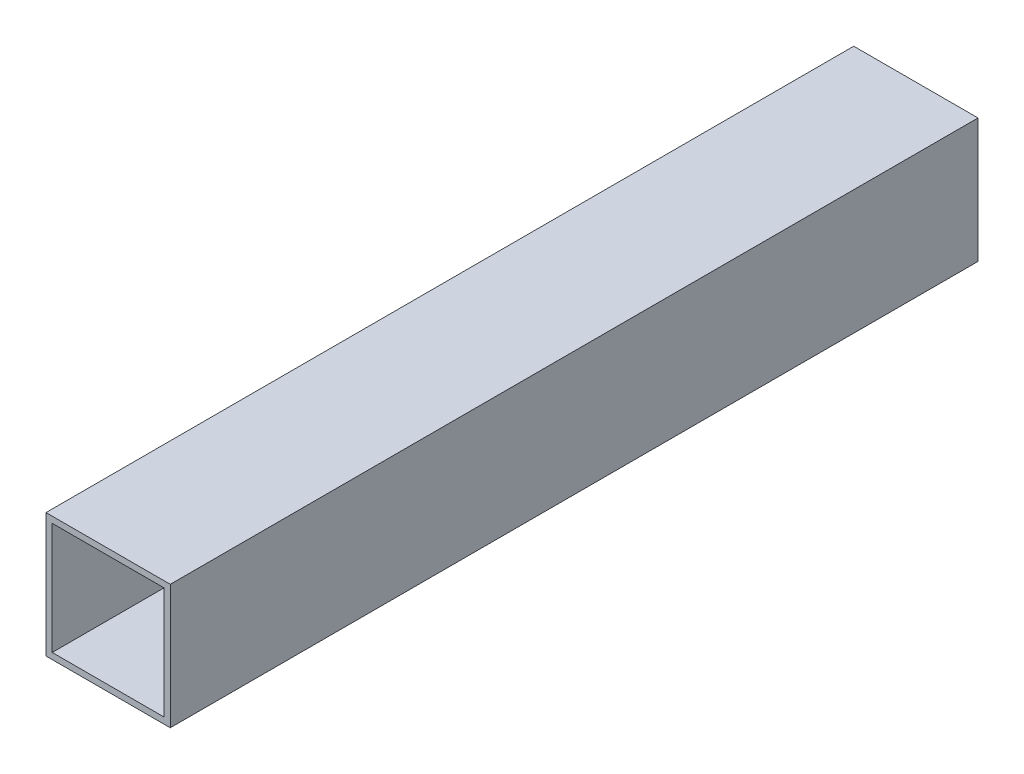
ISO-10303-21;
HEADER;
FILE_DESCRIPTION(('STEP AP214'),'2;1');
FILE_NAME('part.step','',(''),(''),'','','');
FILE_SCHEMA(('AUTOMOTIVE_DESIGN { 1 0 10303 214 1 1 1 1 }'));
ENDSEC;
DATA;
#1=APPLICATION_CONTEXT('core data for automotive mechanical design processes');
#2=APPLICATION_PROTOCOL_DEFINITION('international standard','automotive_design',2000,#1);
#3=PRODUCT_CONTEXT('',#1,'mechanical');
#4=PRODUCT('Part','Part','',(#3));
#5=PRODUCT_RELATED_PRODUCT_CATEGORY('part','',(#4));
#6=PRODUCT_DEFINITION_FORMATION('','',#4);
#7=PRODUCT_DEFINITION_CONTEXT('part definition',#1,'design');
#8=PRODUCT_DEFINITION('design','',#6,#7);
#9=PRODUCT_DEFINITION_SHAPE('','',#8);
#10=(LENGTH_UNIT() NAMED_UNIT(*) SI_UNIT(.MILLI.,.METRE.));
#11=(NAMED_UNIT(*) PLANE_ANGLE_UNIT() SI_UNIT($,.RADIAN.));
#12=(NAMED_UNIT(*) SI_UNIT($,.STERADIAN.) SOLID_ANGLE_UNIT());
#13=UNCERTAINTY_MEASURE_WITH_UNIT(LENGTH_MEASURE(1.E-05),#10,'distance_accuracy_value','');
#14=(GEOMETRIC_REPRESENTATION_CONTEXT(3) GLOBAL_UNCERTAINTY_ASSIGNED_CONTEXT((#13)) GLOBAL_UNIT_ASSIGNED_CONTEXT((#10,
#11,#12)) REPRESENTATION_CONTEXT('',''));
#15=CARTESIAN_POINT('',(0.,0.,0.));
#16=DIRECTION('',(0.,0.,1.));
#17=DIRECTION('',(1.,0.,0.));
#18=AXIS2_PLACEMENT_3D('',#15,#16,#17);
#19=CARTESIAN_POINT('',(0.,0.,325.));
#20=DIRECTION('',(0.,0.,-1.));
#21=DIRECTION('',(-1.,0.,0.));
#22=AXIS2_PLACEMENT_3D('',#19,#20,#21);
#23=PLANE('',#22);
#24=DIRECTION('',(0.,-1.,0.));
#25=VECTOR('',#24,1.);
#26=CARTESIAN_POINT('',(-50.,-50.,325.));
#27=LINE('',#26,#25);
#28=CARTESIAN_POINT('',(-50.,49.9999999999999,325.));
#29=VERTEX_POINT('',#28);
#30=CARTESIAN_POINT('',(-50.,-50.,325.));
#31=VERTEX_POINT('',#30);
#32=EDGE_CURVE('E137',#29,#31,#27,.T.);
#33=ORIENTED_EDGE('',*,*,#32,.T.);
#34=DIRECTION('',(1.,0.,0.));
#35=VECTOR('',#34,1.);
#36=CARTESIAN_POINT('',(-50.,-50.,325.));
#37=LINE('',#36,#35);
#38=CARTESIAN_POINT('',(50.,-50.,325.));
#39=VERTEX_POINT('',#38);
#40=EDGE_CURVE('E143',#31,#39,#37,.T.);
#41=ORIENTED_EDGE('',*,*,#40,.T.);
#42=DIRECTION('',(0.,1.,0.));
#43=VECTOR('',#42,1.);
#44=CARTESIAN_POINT('',(50.,-50.,325.));
#45=LINE('',#44,#43);
#46=CARTESIAN_POINT('',(49.9999999999999,49.9999999999999,325.));
#47=VERTEX_POINT('',#46);
#48=EDGE_CURVE('E146',#39,#47,#45,.T.);
#49=ORIENTED_EDGE('',*,*,#48,.T.);
#50=DIRECTION('',(-1.,0.,0.));
#51=VECTOR('',#50,1.);
#52=CARTESIAN_POINT('',(-50.,49.9999999999999,325.));
#53=LINE('',#52,#51);
#54=EDGE_CURVE('E148',#47,#29,#53,.T.);
#55=ORIENTED_EDGE('',*,*,#54,.T.);
#56=EDGE_LOOP('',(#33,#41,#49,#55));
#57=FACE_BOUND('',#56,.T.);
#58=DIRECTION('',(0.,-1.,0.));
#59=VECTOR('',#58,1.);
#60=CARTESIAN_POINT('',(-45.,-45.,325.));
#61=LINE('',#60,#59);
#62=CARTESIAN_POINT('',(-45.,44.9999999999999,325.));
#63=VERTEX_POINT('',#62);
#64=CARTESIAN_POINT('',(-45.,-45.,325.));
#65=VERTEX_POINT('',#64);
#66=EDGE_CURVE('E103',#63,#65,#61,.T.);
#67=ORIENTED_EDGE('',*,*,#66,.F.);
#68=DIRECTION('',(-1.,0.,0.));
#69=VECTOR('',#68,1.);
#70=CARTESIAN_POINT('',(-45.,44.9999999999999,325.));
#71=LINE('',#70,#69);
#72=CARTESIAN_POINT('',(45.,44.9999999999999,325.));
#73=VERTEX_POINT('',#72);
#74=EDGE_CURVE('E127',#73,#63,#71,.T.);
#75=ORIENTED_EDGE('',*,*,#74,.F.);
#76=DIRECTION('',(0.,1.,0.));
#77=VECTOR('',#76,1.);
#78=CARTESIAN_POINT('',(45.,-45.,325.));
#79=LINE('',#78,#77);
#80=CARTESIAN_POINT('',(45.,-45.,325.));
#81=VERTEX_POINT('',#80);
#82=EDGE_CURVE('E124',#81,#73,#79,.T.);
#83=ORIENTED_EDGE('',*,*,#82,.F.);
#84=DIRECTION('',(1.,0.,0.));
#85=VECTOR('',#84,1.);
#86=CARTESIAN_POINT('',(-45.,-45.,325.));
#87=LINE('',#86,#85);
#88=EDGE_CURVE('E115',#65,#81,#87,.T.);
#89=ORIENTED_EDGE('',*,*,#88,.F.);
#90=EDGE_LOOP('',(#67,#75,#83,#89));
#91=FACE_BOUND('',#90,.T.);
#92=ADVANCED_FACE('F39',(#57,#91),#23,.F.);
#93=CARTESIAN_POINT('',(0.,0.,-325.));
#94=DIRECTION('',(0.,0.,-1.));
#95=DIRECTION('',(-1.,0.,0.));
#96=AXIS2_PLACEMENT_3D('',#93,#94,#95);
#97=PLANE('',#96);
#98=DIRECTION('',(0.,-1.,0.));
#99=VECTOR('',#98,1.);
#100=CARTESIAN_POINT('',(-50.,-50.,-325.));
#101=LINE('',#100,#99);
#102=CARTESIAN_POINT('',(-50.,49.9999999999999,-325.));
#103=VERTEX_POINT('',#102);
#104=CARTESIAN_POINT('',(-50.,-50.,-325.));
#105=VERTEX_POINT('',#104);
#106=EDGE_CURVE('E119',#103,#105,#101,.T.);
#107=ORIENTED_EDGE('',*,*,#106,.F.);
#108=DIRECTION('',(-1.,0.,0.));
#109=VECTOR('',#108,1.);
#110=CARTESIAN_POINT('',(-50.,49.9999999999999,-325.));
#111=LINE('',#110,#109);
#112=CARTESIAN_POINT('',(49.9999999999999,49.9999999999999,-325.));
#113=VERTEX_POINT('',#112);
#114=EDGE_CURVE('E142',#113,#103,#111,.T.);
#115=ORIENTED_EDGE('',*,*,#114,.F.);
#116=DIRECTION('',(0.,1.,0.));
#117=VECTOR('',#116,1.);
#118=CARTESIAN_POINT('',(50.,-50.,-325.));
#119=LINE('',#118,#117);
#120=CARTESIAN_POINT('',(50.,-50.,-325.));
#121=VERTEX_POINT('',#120);
#122=EDGE_CURVE('E154',#121,#113,#119,.T.);
#123=ORIENTED_EDGE('',*,*,#122,.F.);
#124=DIRECTION('',(1.,0.,0.));
#125=VECTOR('',#124,1.);
#126=CARTESIAN_POINT('',(-50.,-50.,-325.));
#127=LINE('',#126,#125);
#128=EDGE_CURVE('E152',#105,#121,#127,.T.);
#129=ORIENTED_EDGE('',*,*,#128,.F.);
#130=EDGE_LOOP('',(#107,#115,#123,#129));
#131=FACE_BOUND('',#130,.T.);
#132=DIRECTION('',(-1.,0.,0.));
#133=VECTOR('',#132,1.);
#134=CARTESIAN_POINT('',(-45.,44.9999999999999,-325.));
#135=LINE('',#134,#133);
#136=CARTESIAN_POINT('',(45.,44.9999999999999,-325.));
#137=VERTEX_POINT('',#136);
#138=CARTESIAN_POINT('',(-45.,44.9999999999999,-325.));
#139=VERTEX_POINT('',#138);
#140=EDGE_CURVE('E114',#137,#139,#135,.T.);
#141=ORIENTED_EDGE('',*,*,#140,.T.);
#142=DIRECTION('',(0.,-1.,0.));
#143=VECTOR('',#142,1.);
#144=CARTESIAN_POINT('',(-45.,-45.,-325.));
#145=LINE('',#144,#143);
#146=CARTESIAN_POINT('',(-45.,-45.,-325.));
#147=VERTEX_POINT('',#146);
#148=EDGE_CURVE('E65',#139,#147,#145,.T.);
#149=ORIENTED_EDGE('',*,*,#148,.T.);
#150=DIRECTION('',(1.,0.,0.));
#151=VECTOR('',#150,1.);
#152=CARTESIAN_POINT('',(-45.,-45.,-325.));
#153=LINE('',#152,#151);
#154=CARTESIAN_POINT('',(45.,-45.,-325.));
#155=VERTEX_POINT('',#154);
#156=EDGE_CURVE('E117',#147,#155,#153,.T.);
#157=ORIENTED_EDGE('',*,*,#156,.T.);
#158=DIRECTION('',(0.,1.,0.));
#159=VECTOR('',#158,1.);
#160=CARTESIAN_POINT('',(45.,-45.,-325.));
#161=LINE('',#160,#159);
#162=EDGE_CURVE('E132',#155,#137,#161,.T.);
#163=ORIENTED_EDGE('',*,*,#162,.T.);
#164=EDGE_LOOP('',(#141,#149,#157,#163));
#165=FACE_BOUND('',#164,.T.);
#166=ADVANCED_FACE('F171',(#131,#165),#97,.T.);
#167=CARTESIAN_POINT('',(-50.,-50.,325.));
#168=DIRECTION('',(1.,0.,0.));
#169=DIRECTION('',(0.,0.,-1.));
#170=AXIS2_PLACEMENT_3D('',#167,#168,#169);
#171=PLANE('',#170);
#172=ORIENTED_EDGE('',*,*,#106,.T.);
#173=DIRECTION('',(0.,0.,-1.));
#174=VECTOR('',#173,1.);
#175=CARTESIAN_POINT('',(-50.,-50.,325.));
#176=LINE('',#175,#174);
#177=EDGE_CURVE('E11',#31,#105,#176,.T.);
#178=ORIENTED_EDGE('',*,*,#177,.F.);
#179=ORIENTED_EDGE('',*,*,#32,.F.);
#180=DIRECTION('',(0.,0.,-1.));
#181=VECTOR('',#180,1.);
#182=CARTESIAN_POINT('',(-50.,49.9999999999999,325.));
#183=LINE('',#182,#181);
#184=EDGE_CURVE('E149',#29,#103,#183,.T.);
#185=ORIENTED_EDGE('',*,*,#184,.T.);
#186=EDGE_LOOP('',(#172,#178,#179,#185));
#187=FACE_BOUND('',#186,.T.);
#188=ADVANCED_FACE('F41',(#187),#171,.F.);
#189=CARTESIAN_POINT('',(-50.,-50.,325.));
#190=DIRECTION('',(0.,1.,0.));
#191=DIRECTION('',(0.,0.,1.));
#192=AXIS2_PLACEMENT_3D('',#189,#190,#191);
#193=PLANE('',#192);
#194=ORIENTED_EDGE('',*,*,#128,.T.);
#195=DIRECTION('',(0.,0.,-1.));
#196=VECTOR('',#195,1.);
#197=CARTESIAN_POINT('',(50.,-50.,325.));
#198=LINE('',#197,#196);
#199=EDGE_CURVE('E50',#39,#121,#198,.T.);
#200=ORIENTED_EDGE('',*,*,#199,.F.);
#201=ORIENTED_EDGE('',*,*,#40,.F.);
#202=ORIENTED_EDGE('',*,*,#177,.T.);
#203=EDGE_LOOP('',(#194,#200,#201,#202));
#204=FACE_BOUND('',#203,.T.);
#205=ADVANCED_FACE('F181',(#204),#193,.F.);
#206=CARTESIAN_POINT('',(50.,-50.,325.));
#207=DIRECTION('',(-1.,0.,0.));
#208=DIRECTION('',(0.,-1.,0.));
#209=AXIS2_PLACEMENT_3D('',#206,#207,#208);
#210=PLANE('',#209);
#211=ORIENTED_EDGE('',*,*,#122,.T.);
#212=DIRECTION('',(0.,0.,-1.));
#213=VECTOR('',#212,1.);
#214=CARTESIAN_POINT('',(49.9999999999999,49.9999999999999,325.));
#215=LINE('',#214,#213);
#216=EDGE_CURVE('E158',#47,#113,#215,.T.);
#217=ORIENTED_EDGE('',*,*,#216,.F.);
#218=ORIENTED_EDGE('',*,*,#48,.F.);
#219=ORIENTED_EDGE('',*,*,#199,.T.);
#220=EDGE_LOOP('',(#211,#217,#218,#219));
#221=FACE_BOUND('',#220,.T.);
#222=ADVANCED_FACE('F170',(#221),#210,.F.);
#223=CARTESIAN_POINT('',(-50.,49.9999999999999,325.));
#224=DIRECTION('',(0.,-1.,0.));
#225=DIRECTION('',(0.,0.,-1.));
#226=AXIS2_PLACEMENT_3D('',#223,#224,#225);
#227=PLANE('',#226);
#228=ORIENTED_EDGE('',*,*,#114,.T.);
#229=ORIENTED_EDGE('',*,*,#184,.F.);
#230=ORIENTED_EDGE('',*,*,#54,.F.);
#231=ORIENTED_EDGE('',*,*,#216,.T.);
#232=EDGE_LOOP('',(#228,#229,#230,#231));
#233=FACE_BOUND('',#232,.T.);
#234=ADVANCED_FACE('F180',(#233),#227,.F.);
#235=CARTESIAN_POINT('',(-45.,-45.,325.));
#236=DIRECTION('',(1.,0.,0.));
#237=DIRECTION('',(0.,0.,-1.));
#238=AXIS2_PLACEMENT_3D('',#235,#236,#237);
#239=PLANE('',#238);
#240=ORIENTED_EDGE('',*,*,#148,.F.);
#241=DIRECTION('',(0.,0.,-1.));
#242=VECTOR('',#241,1.);
#243=CARTESIAN_POINT('',(-45.,44.9999999999999,325.));
#244=LINE('',#243,#242);
#245=EDGE_CURVE('E109',#63,#139,#244,.T.);
#246=ORIENTED_EDGE('',*,*,#245,.F.);
#247=ORIENTED_EDGE('',*,*,#66,.T.);
#248=DIRECTION('',(0.,0.,-1.));
#249=VECTOR('',#248,1.);
#250=CARTESIAN_POINT('',(-45.,-45.,325.));
#251=LINE('',#250,#249);
#252=EDGE_CURVE('E110',#65,#147,#251,.T.);
#253=ORIENTED_EDGE('',*,*,#252,.T.);
#254=EDGE_LOOP('',(#240,#246,#247,#253));
#255=FACE_BOUND('',#254,.T.);
#256=ADVANCED_FACE('F107',(#255),#239,.T.);
#257=CARTESIAN_POINT('',(-45.,-45.,325.));
#258=DIRECTION('',(0.,1.,0.));
#259=DIRECTION('',(0.,0.,1.));
#260=AXIS2_PLACEMENT_3D('',#257,#258,#259);
#261=PLANE('',#260);
#262=ORIENTED_EDGE('',*,*,#156,.F.);
#263=ORIENTED_EDGE('',*,*,#252,.F.);
#264=ORIENTED_EDGE('',*,*,#88,.T.);
#265=DIRECTION('',(0.,0.,-1.));
#266=VECTOR('',#265,1.);
#267=CARTESIAN_POINT('',(45.,-45.,325.));
#268=LINE('',#267,#266);
#269=EDGE_CURVE('E122',#81,#155,#268,.T.);
#270=ORIENTED_EDGE('',*,*,#269,.T.);
#271=EDGE_LOOP('',(#262,#263,#264,#270));
#272=FACE_BOUND('',#271,.T.);
#273=ADVANCED_FACE('F116',(#272),#261,.T.);
#274=CARTESIAN_POINT('',(45.,-45.,325.));
#275=DIRECTION('',(-1.,0.,0.));
#276=DIRECTION('',(0.,-1.,0.));
#277=AXIS2_PLACEMENT_3D('',#274,#275,#276);
#278=PLANE('',#277);
#279=ORIENTED_EDGE('',*,*,#162,.F.);
#280=ORIENTED_EDGE('',*,*,#269,.F.);
#281=ORIENTED_EDGE('',*,*,#82,.T.);
#282=DIRECTION('',(0.,0.,-1.));
#283=VECTOR('',#282,1.);
#284=CARTESIAN_POINT('',(45.,44.9999999999999,325.));
#285=LINE('',#284,#283);
#286=EDGE_CURVE('E53',#73,#137,#285,.T.);
#287=ORIENTED_EDGE('',*,*,#286,.T.);
#288=EDGE_LOOP('',(#279,#280,#281,#287));
#289=FACE_BOUND('',#288,.T.);
#290=ADVANCED_FACE('F207',(#289),#278,.T.);
#291=CARTESIAN_POINT('',(-45.,44.9999999999999,325.));
#292=DIRECTION('',(0.,-1.,0.));
#293=DIRECTION('',(0.,0.,-1.));
#294=AXIS2_PLACEMENT_3D('',#291,#292,#293);
#295=PLANE('',#294);
#296=ORIENTED_EDGE('',*,*,#140,.F.);
#297=ORIENTED_EDGE('',*,*,#286,.F.);
#298=ORIENTED_EDGE('',*,*,#74,.T.);
#299=ORIENTED_EDGE('',*,*,#245,.T.);
#300=EDGE_LOOP('',(#296,#297,#298,#299));
#301=FACE_BOUND('',#300,.T.);
#302=ADVANCED_FACE('F208',(#301),#295,.T.);
#303=CLOSED_SHELL('',(#92,#166,#188,#205,#222,#234,#256,#273,#290,#302));
#304=MANIFOLD_SOLID_BREP('B2',#303);
#305=ADVANCED_BREP_SHAPE_REPRESENTATION('',(#18,#304),#14);
#306=SHAPE_DEFINITION_REPRESENTATION(#9,#305);
ENDSEC;
END-ISO-10303-21;
